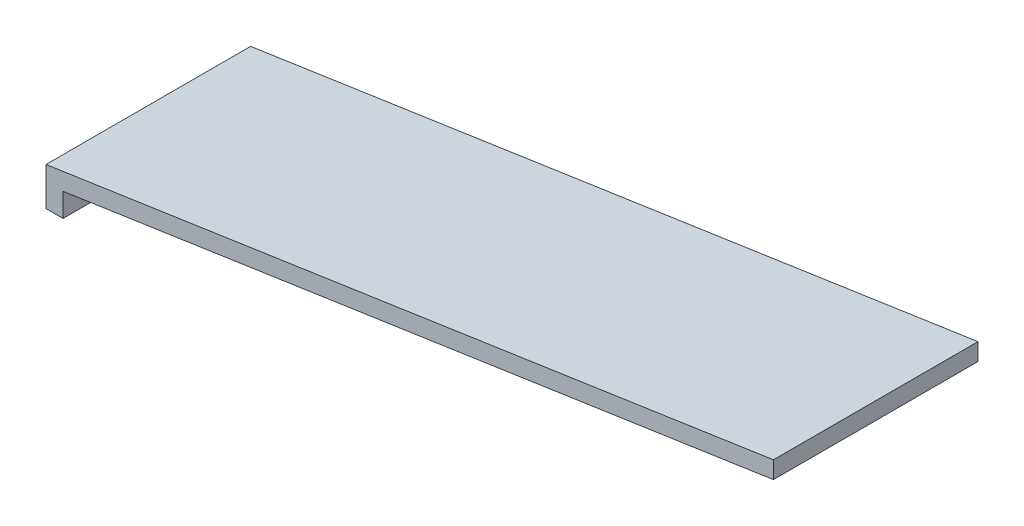
ISO-10303-21;
HEADER;
FILE_DESCRIPTION(('STEP AP214'),'2;1');
FILE_NAME('part.step','',(''),(''),'','','');
FILE_SCHEMA(('AUTOMOTIVE_DESIGN { 1 0 10303 214 1 1 1 1 }'));
ENDSEC;
DATA;
#1=APPLICATION_CONTEXT('core data for automotive mechanical design processes');
#2=APPLICATION_PROTOCOL_DEFINITION('international standard','automotive_design',2000,#1);
#3=PRODUCT_CONTEXT('',#1,'mechanical');
#4=PRODUCT('Part','Part','',(#3));
#5=PRODUCT_RELATED_PRODUCT_CATEGORY('part','',(#4));
#6=PRODUCT_DEFINITION_FORMATION('','',#4);
#7=PRODUCT_DEFINITION_CONTEXT('part definition',#1,'design');
#8=PRODUCT_DEFINITION('design','',#6,#7);
#9=PRODUCT_DEFINITION_SHAPE('','',#8);
#10=(LENGTH_UNIT() NAMED_UNIT(*) SI_UNIT(.MILLI.,.METRE.));
#11=(NAMED_UNIT(*) PLANE_ANGLE_UNIT() SI_UNIT($,.RADIAN.));
#12=(NAMED_UNIT(*) SI_UNIT($,.STERADIAN.) SOLID_ANGLE_UNIT());
#13=UNCERTAINTY_MEASURE_WITH_UNIT(LENGTH_MEASURE(1.E-05),#10,'distance_accuracy_value','');
#14=(GEOMETRIC_REPRESENTATION_CONTEXT(3) GLOBAL_UNCERTAINTY_ASSIGNED_CONTEXT((#13)) GLOBAL_UNIT_ASSIGNED_CONTEXT((#10,
#11,#12)) REPRESENTATION_CONTEXT('',''));
#15=CARTESIAN_POINT('',(0.,0.,0.));
#16=DIRECTION('',(0.,0.,1.));
#17=DIRECTION('',(1.,0.,0.));
#18=AXIS2_PLACEMENT_3D('',#15,#16,#17);
#19=CARTESIAN_POINT('',(12.,2.29293821747763,-1.45));
#20=DIRECTION('',(-0.146828724135006,0.989161931014779,0.));
#21=DIRECTION('',(-0.989161931014779,-0.146828724135006,0.));
#22=AXIS2_PLACEMENT_3D('',#19,#20,#21);
#23=PLANE('',#22);
#24=DIRECTION('',(-0.989161931014779,-0.146828724135006,0.));
#25=VECTOR('',#24,1.);
#26=CARTESIAN_POINT('',(12.,2.29293821747763,2.15));
#27=LINE('',#26,#25);
#28=CARTESIAN_POINT('',(12.,2.29293821747763,2.15));
#29=VERTEX_POINT('',#28);
#30=CARTESIAN_POINT('',(-0.799999999999998,0.392938217477634,2.15));
#31=VERTEX_POINT('',#30);
#32=EDGE_CURVE('E120',#29,#31,#27,.T.);
#33=ORIENTED_EDGE('',*,*,#32,.F.);
#34=DIRECTION('',(0.,0.,1.));
#35=VECTOR('',#34,1.);
#36=CARTESIAN_POINT('',(12.,2.29293821747763,-1.45));
#37=LINE('',#36,#35);
#38=CARTESIAN_POINT('',(12.,2.29293821747763,-1.45));
#39=VERTEX_POINT('',#38);
#40=EDGE_CURVE('E11',#39,#29,#37,.T.);
#41=ORIENTED_EDGE('',*,*,#40,.F.);
#42=DIRECTION('',(-0.989161931014779,-0.146828724135006,0.));
#43=VECTOR('',#42,1.);
#44=CARTESIAN_POINT('',(12.,2.29293821747763,-1.45));
#45=LINE('',#44,#43);
#46=CARTESIAN_POINT('',(-0.799999999999998,0.392938217477634,-1.45));
#47=VERTEX_POINT('',#46);
#48=EDGE_CURVE('E134',#39,#47,#45,.T.);
#49=ORIENTED_EDGE('',*,*,#48,.T.);
#50=DIRECTION('',(0.,0.,1.));
#51=VECTOR('',#50,1.);
#52=CARTESIAN_POINT('',(-0.799999999999998,0.392938217477634,-1.45));
#53=LINE('',#52,#51);
#54=EDGE_CURVE('E38',#47,#31,#53,.T.);
#55=ORIENTED_EDGE('',*,*,#54,.T.);
#56=EDGE_LOOP('',(#33,#41,#49,#55));
#57=FACE_BOUND('',#56,.T.);
#58=ADVANCED_FACE('F35',(#57),#23,.T.);
#59=CARTESIAN_POINT('',(12.,2.29293821747763,-1.45));
#60=DIRECTION('',(1.,0.,0.));
#61=DIRECTION('',(0.,0.,-1.));
#62=AXIS2_PLACEMENT_3D('',#59,#60,#61);
#63=PLANE('',#62);
#64=DIRECTION('',(0.,1.,0.));
#65=VECTOR('',#64,1.);
#66=CARTESIAN_POINT('',(12.,2.29293821747763,2.15));
#67=LINE('',#66,#65);
#68=CARTESIAN_POINT('',(12.,1.98965117155156,2.15));
#69=VERTEX_POINT('',#68);
#70=EDGE_CURVE('E132',#69,#29,#67,.T.);
#71=ORIENTED_EDGE('',*,*,#70,.F.);
#72=DIRECTION('',(0.,0.,1.));
#73=VECTOR('',#72,1.);
#74=CARTESIAN_POINT('',(12.,1.98965117155156,-1.45));
#75=LINE('',#74,#73);
#76=CARTESIAN_POINT('',(12.,1.98965117155156,-1.45));
#77=VERTEX_POINT('',#76);
#78=EDGE_CURVE('E44',#77,#69,#75,.T.);
#79=ORIENTED_EDGE('',*,*,#78,.F.);
#80=DIRECTION('',(0.,1.,0.));
#81=VECTOR('',#80,1.);
#82=CARTESIAN_POINT('',(12.,2.29293821747763,-1.45));
#83=LINE('',#82,#81);
#84=EDGE_CURVE('E110',#77,#39,#83,.T.);
#85=ORIENTED_EDGE('',*,*,#84,.T.);
#86=ORIENTED_EDGE('',*,*,#40,.T.);
#87=EDGE_LOOP('',(#71,#79,#85,#86));
#88=FACE_BOUND('',#87,.T.);
#89=ADVANCED_FACE('F142',(#88),#63,.T.);
#90=CARTESIAN_POINT('',(12.,1.98965117155156,-1.45));
#91=DIRECTION('',(0.146828724135006,-0.989161931014779,0.));
#92=DIRECTION('',(0.989161931014779,0.146828724135006,0.));
#93=AXIS2_PLACEMENT_3D('',#90,#91,#92);
#94=PLANE('',#93);
#95=DIRECTION('',(0.989161931014779,0.146828724135006,0.));
#96=VECTOR('',#95,1.);
#97=CARTESIAN_POINT('',(12.,1.98965117155156,2.15));
#98=LINE('',#97,#96);
#99=CARTESIAN_POINT('',(-0.499999999999997,0.134182421551563,2.15));
#100=VERTEX_POINT('',#99);
#101=EDGE_CURVE('E97',#100,#69,#98,.T.);
#102=ORIENTED_EDGE('',*,*,#101,.F.);
#103=DIRECTION('',(0.,0.,1.));
#104=VECTOR('',#103,1.);
#105=CARTESIAN_POINT('',(-0.499999999999997,0.134182421551563,-1.45));
#106=LINE('',#105,#104);
#107=CARTESIAN_POINT('',(-0.499999999999997,0.134182421551563,-1.45));
#108=VERTEX_POINT('',#107);
#109=EDGE_CURVE('E92',#108,#100,#106,.T.);
#110=ORIENTED_EDGE('',*,*,#109,.F.);
#111=DIRECTION('',(0.989161931014779,0.146828724135006,0.));
#112=VECTOR('',#111,1.);
#113=CARTESIAN_POINT('',(12.,1.98965117155156,-1.45));
#114=LINE('',#113,#112);
#115=EDGE_CURVE('E95',#108,#77,#114,.T.);
#116=ORIENTED_EDGE('',*,*,#115,.T.);
#117=ORIENTED_EDGE('',*,*,#78,.T.);
#118=EDGE_LOOP('',(#102,#110,#116,#117));
#119=FACE_BOUND('',#118,.T.);
#120=ADVANCED_FACE('F94',(#119),#94,.T.);
#121=CARTESIAN_POINT('',(-0.499999999999998,-0.280061782522364,-1.45));
#122=DIRECTION('',(1.,0.,0.));
#123=DIRECTION('',(0.,1.,0.));
#124=AXIS2_PLACEMENT_3D('',#121,#122,#123);
#125=PLANE('',#124);
#126=DIRECTION('',(0.,1.,0.));
#127=VECTOR('',#126,1.);
#128=CARTESIAN_POINT('',(-0.499999999999998,-0.280061782522364,2.15));
#129=LINE('',#128,#127);
#130=CARTESIAN_POINT('',(-0.499999999999998,-0.280061782522364,2.15));
#131=VERTEX_POINT('',#130);
#132=EDGE_CURVE('E129',#131,#100,#129,.T.);
#133=ORIENTED_EDGE('',*,*,#132,.F.);
#134=DIRECTION('',(0.,0.,1.));
#135=VECTOR('',#134,1.);
#136=CARTESIAN_POINT('',(-0.499999999999998,-0.280061782522364,-1.45));
#137=LINE('',#136,#135);
#138=CARTESIAN_POINT('',(-0.499999999999998,-0.280061782522364,-1.45));
#139=VERTEX_POINT('',#138);
#140=EDGE_CURVE('E102',#139,#131,#137,.T.);
#141=ORIENTED_EDGE('',*,*,#140,.F.);
#142=DIRECTION('',(0.,1.,0.));
#143=VECTOR('',#142,1.);
#144=CARTESIAN_POINT('',(-0.499999999999998,-0.280061782522364,-1.45));
#145=LINE('',#144,#143);
#146=EDGE_CURVE('E108',#139,#108,#145,.T.);
#147=ORIENTED_EDGE('',*,*,#146,.T.);
#148=ORIENTED_EDGE('',*,*,#109,.T.);
#149=EDGE_LOOP('',(#133,#141,#147,#148));
#150=FACE_BOUND('',#149,.T.);
#151=ADVANCED_FACE('F112',(#150),#125,.T.);
#152=CARTESIAN_POINT('',(-0.799999999999998,-0.280061782522364,-1.45));
#153=DIRECTION('',(0.,-1.,0.));
#154=DIRECTION('',(1.,0.,0.));
#155=AXIS2_PLACEMENT_3D('',#152,#153,#154);
#156=PLANE('',#155);
#157=DIRECTION('',(1.,0.,0.));
#158=VECTOR('',#157,1.);
#159=CARTESIAN_POINT('',(-0.799999999999998,-0.280061782522364,2.15));
#160=LINE('',#159,#158);
#161=CARTESIAN_POINT('',(-0.799999999999998,-0.280061782522364,2.15));
#162=VERTEX_POINT('',#161);
#163=EDGE_CURVE('E126',#162,#131,#160,.T.);
#164=ORIENTED_EDGE('',*,*,#163,.F.);
#165=DIRECTION('',(0.,0.,1.));
#166=VECTOR('',#165,1.);
#167=CARTESIAN_POINT('',(-0.799999999999998,-0.280061782522364,-1.45));
#168=LINE('',#167,#166);
#169=CARTESIAN_POINT('',(-0.799999999999998,-0.280061782522364,-1.45));
#170=VERTEX_POINT('',#169);
#171=EDGE_CURVE('E137',#170,#162,#168,.T.);
#172=ORIENTED_EDGE('',*,*,#171,.F.);
#173=DIRECTION('',(1.,0.,0.));
#174=VECTOR('',#173,1.);
#175=CARTESIAN_POINT('',(-0.799999999999998,-0.280061782522364,-1.45));
#176=LINE('',#175,#174);
#177=EDGE_CURVE('E113',#170,#139,#176,.T.);
#178=ORIENTED_EDGE('',*,*,#177,.T.);
#179=ORIENTED_EDGE('',*,*,#140,.T.);
#180=EDGE_LOOP('',(#164,#172,#178,#179));
#181=FACE_BOUND('',#180,.T.);
#182=ADVANCED_FACE('F155',(#181),#156,.T.);
#183=CARTESIAN_POINT('',(-0.799999999999998,0.392938217477634,-1.45));
#184=DIRECTION('',(-1.,0.,0.));
#185=DIRECTION('',(0.,-1.,0.));
#186=AXIS2_PLACEMENT_3D('',#183,#184,#185);
#187=PLANE('',#186);
#188=DIRECTION('',(0.,-1.,0.));
#189=VECTOR('',#188,1.);
#190=CARTESIAN_POINT('',(-0.799999999999998,0.392938217477634,2.15));
#191=LINE('',#190,#189);
#192=EDGE_CURVE('E123',#31,#162,#191,.T.);
#193=ORIENTED_EDGE('',*,*,#192,.F.);
#194=ORIENTED_EDGE('',*,*,#54,.F.);
#195=DIRECTION('',(0.,-1.,0.));
#196=VECTOR('',#195,1.);
#197=CARTESIAN_POINT('',(-0.799999999999998,0.392938217477634,-1.45));
#198=LINE('',#197,#196);
#199=EDGE_CURVE('E115',#47,#170,#198,.T.);
#200=ORIENTED_EDGE('',*,*,#199,.T.);
#201=ORIENTED_EDGE('',*,*,#171,.T.);
#202=EDGE_LOOP('',(#193,#194,#200,#201));
#203=FACE_BOUND('',#202,.T.);
#204=ADVANCED_FACE('F139',(#203),#187,.T.);
#205=CARTESIAN_POINT('',(0.,0.,-1.45));
#206=DIRECTION('',(0.,0.,1.));
#207=DIRECTION('',(1.,0.,0.));
#208=AXIS2_PLACEMENT_3D('',#205,#206,#207);
#209=PLANE('',#208);
#210=ORIENTED_EDGE('',*,*,#48,.F.);
#211=ORIENTED_EDGE('',*,*,#84,.F.);
#212=ORIENTED_EDGE('',*,*,#115,.F.);
#213=ORIENTED_EDGE('',*,*,#146,.F.);
#214=ORIENTED_EDGE('',*,*,#177,.F.);
#215=ORIENTED_EDGE('',*,*,#199,.F.);
#216=EDGE_LOOP('',(#210,#211,#212,#213,#214,#215));
#217=FACE_BOUND('',#216,.T.);
#218=ADVANCED_FACE('F106',(#217),#209,.F.);
#219=CARTESIAN_POINT('',(0.,0.,2.15));
#220=DIRECTION('',(0.,0.,1.));
#221=DIRECTION('',(1.,0.,0.));
#222=AXIS2_PLACEMENT_3D('',#219,#220,#221);
#223=PLANE('',#222);
#224=ORIENTED_EDGE('',*,*,#32,.T.);
#225=ORIENTED_EDGE('',*,*,#192,.T.);
#226=ORIENTED_EDGE('',*,*,#163,.T.);
#227=ORIENTED_EDGE('',*,*,#132,.T.);
#228=ORIENTED_EDGE('',*,*,#101,.T.);
#229=ORIENTED_EDGE('',*,*,#70,.T.);
#230=EDGE_LOOP('',(#224,#225,#226,#227,#228,#229));
#231=FACE_BOUND('',#230,.T.);
#232=ADVANCED_FACE('F141',(#231),#223,.T.);
#233=CLOSED_SHELL('',(#58,#89,#120,#151,#182,#204,#218,#232));
#234=MANIFOLD_SOLID_BREP('B2',#233);
#235=ADVANCED_BREP_SHAPE_REPRESENTATION('',(#18,#234),#14);
#236=SHAPE_DEFINITION_REPRESENTATION(#9,#235);
ENDSEC;
END-ISO-10303-21;
